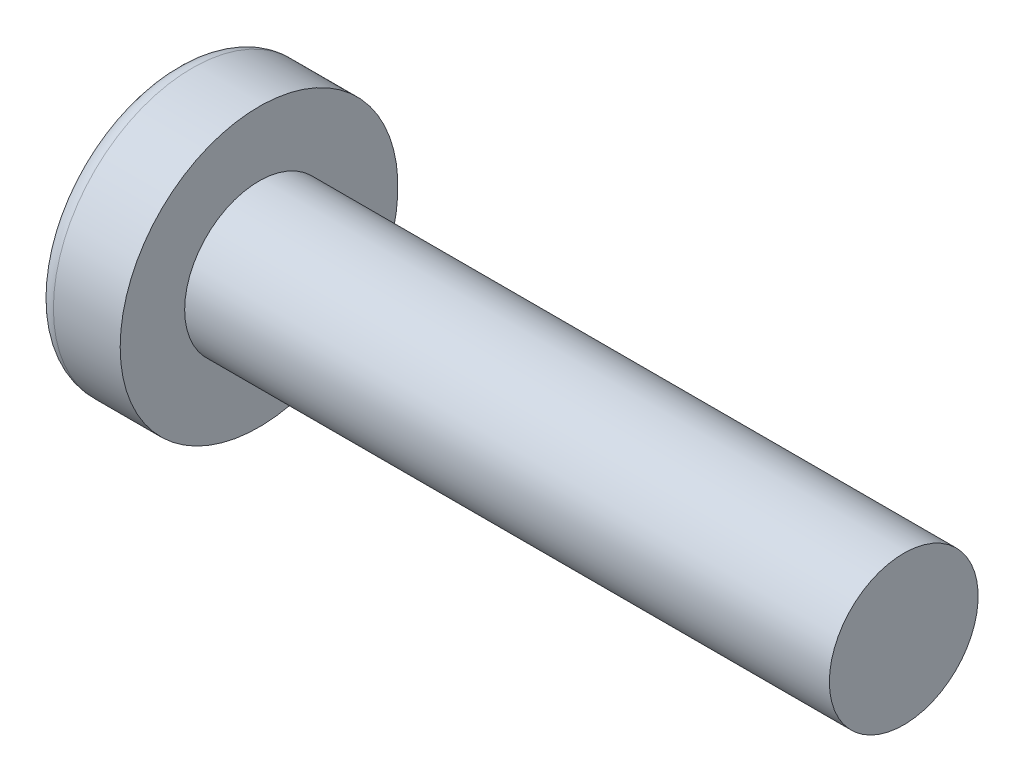
ISO-10303-21;
HEADER;
FILE_DESCRIPTION(('STEP AP214'),'2;1');
FILE_NAME('part.step','',(''),(''),'','','');
FILE_SCHEMA(('AUTOMOTIVE_DESIGN { 1 0 10303 214 1 1 1 1 }'));
ENDSEC;
DATA;
#1=APPLICATION_CONTEXT('core data for automotive mechanical design processes');
#2=APPLICATION_PROTOCOL_DEFINITION('international standard','automotive_design',2000,#1);
#3=PRODUCT_CONTEXT('',#1,'mechanical');
#4=PRODUCT('Part','Part','',(#3));
#5=PRODUCT_RELATED_PRODUCT_CATEGORY('part','',(#4));
#6=PRODUCT_DEFINITION_FORMATION('','',#4);
#7=PRODUCT_DEFINITION_CONTEXT('part definition',#1,'design');
#8=PRODUCT_DEFINITION('design','',#6,#7);
#9=PRODUCT_DEFINITION_SHAPE('','',#8);
#10=(LENGTH_UNIT() NAMED_UNIT(*) SI_UNIT(.MILLI.,.METRE.));
#11=(NAMED_UNIT(*) PLANE_ANGLE_UNIT() SI_UNIT($,.RADIAN.));
#12=(NAMED_UNIT(*) SI_UNIT($,.STERADIAN.) SOLID_ANGLE_UNIT());
#13=UNCERTAINTY_MEASURE_WITH_UNIT(LENGTH_MEASURE(1.E-05),#10,'distance_accuracy_value','');
#14=(GEOMETRIC_REPRESENTATION_CONTEXT(3) GLOBAL_UNCERTAINTY_ASSIGNED_CONTEXT((#13)) GLOBAL_UNIT_ASSIGNED_CONTEXT((#10,
#11,#12)) REPRESENTATION_CONTEXT('',''));
#15=CARTESIAN_POINT('',(0.,0.,0.));
#16=DIRECTION('',(0.,0.,1.));
#17=DIRECTION('',(1.,0.,0.));
#18=AXIS2_PLACEMENT_3D('',#15,#16,#17);
#19=CARTESIAN_POINT('',(5.,0.,0.));
#20=DIRECTION('',(-1.,0.,0.));
#21=DIRECTION('',(0.,1.,0.));
#22=AXIS2_PLACEMENT_3D('',#19,#20,#21);
#23=SPHERICAL_SURFACE('',#22,5.);
#24=CARTESIAN_POINT('',(0.747150706810477,0.,0.));
#25=DIRECTION('',(-1.,0.,0.));
#26=DIRECTION('',(0.,0.,1.));
#27=AXIS2_PLACEMENT_3D('',#24,#25,#26);
#28=CIRCLE('',#27,2.62931034482759);
#29=CARTESIAN_POINT('',(0.747150706810477,0.,2.62931034482759));
#30=VERTEX_POINT('',#29);
#31=EDGE_CURVE('E157',#30,#30,#28,.T.);
#32=ORIENTED_EDGE('',*,*,#31,.T.);
#33=EDGE_LOOP('',(#32));
#34=FACE_BOUND('',#33,.T.);
#35=CARTESIAN_POINT('',(4.98382636322272,-0.153868112043297,0.));
#36=DIRECTION('',(-0.104537710696287,-0.994520923380891,0.));
#37=DIRECTION('',(0.994520923380891,-0.104537710696287,0.));
#38=AXIS2_PLACEMENT_3D('',#35,#36,#37);
#39=CIRCLE('',#38,4.99760572850336);
#40=CARTESIAN_POINT('',(0.188596138461545,0.350175974082162,1.31444652548076));
#41=VERTEX_POINT('',#40);
#42=CARTESIAN_POINT('',(0.0270341343313624,0.367158343834486,0.367158343834487));
#43=VERTEX_POINT('',#42);
#44=EDGE_CURVE('E188',#41,#43,#39,.T.);
#45=ORIENTED_EDGE('',*,*,#44,.F.);
#46=CARTESIAN_POINT('',(3.98403090792016,0.,-1.41352221506761));
#47=DIRECTION('',(0.583636048152575,0.,0.812015371342713));
#48=DIRECTION('',(0.812015371342714,0.,-0.583636048152575));
#49=AXIS2_PLACEMENT_3D('',#46,#47,#48);
#50=CIRCLE('',#49,4.68719124331927);
#51=CARTESIAN_POINT('',(0.188596138461544,-0.350175974082172,1.31444652548076));
#52=VERTEX_POINT('',#51);
#53=EDGE_CURVE('E153',#41,#52,#50,.T.);
#54=ORIENTED_EDGE('',*,*,#53,.T.);
#55=CARTESIAN_POINT('',(4.98382636322272,0.153868112043297,0.));
#56=DIRECTION('',(-0.104537710696287,0.994520923380891,0.));
#57=DIRECTION('',(-0.994520923380891,-0.104537710696287,0.));
#58=AXIS2_PLACEMENT_3D('',#55,#56,#57);
#59=CIRCLE('',#58,4.99760572850336);
#60=CARTESIAN_POINT('',(0.0270341343313616,-0.367158343834489,0.367158343834487));
#61=VERTEX_POINT('',#60);
#62=EDGE_CURVE('E109',#61,#52,#59,.T.);
#63=ORIENTED_EDGE('',*,*,#62,.F.);
#64=CARTESIAN_POINT('',(4.98382636322272,0.,-0.153868112043297));
#65=DIRECTION('',(-0.104537710696287,0.,-0.994520923380891));
#66=DIRECTION('',(-0.994520923380891,0.,0.104537710696287));
#67=AXIS2_PLACEMENT_3D('',#64,#65,#66);
#68=CIRCLE('',#67,4.99760572850336);
#69=CARTESIAN_POINT('',(0.188596138461545,-1.31444652548077,0.350175974082167));
#70=VERTEX_POINT('',#69);
#71=EDGE_CURVE('E134',#70,#61,#68,.T.);
#72=ORIENTED_EDGE('',*,*,#71,.F.);
#73=CARTESIAN_POINT('',(3.98403090792016,1.41352221506761,0.));
#74=DIRECTION('',(0.583636048152575,-0.812015371342713,0.));
#75=DIRECTION('',(0.812015371342714,0.583636048152575,0.));
#76=AXIS2_PLACEMENT_3D('',#73,#74,#75);
#77=CIRCLE('',#76,4.68719124331927);
#78=CARTESIAN_POINT('',(0.188596138461545,-1.31444652548077,-0.350175974082167));
#79=VERTEX_POINT('',#78);
#80=EDGE_CURVE('E142',#70,#79,#77,.T.);
#81=ORIENTED_EDGE('',*,*,#80,.T.);
#82=CARTESIAN_POINT('',(4.98382636322272,0.,0.153868112043297));
#83=DIRECTION('',(-0.104537710696287,0.,0.994520923380891));
#84=DIRECTION('',(0.994520923380891,0.,0.104537710696287));
#85=AXIS2_PLACEMENT_3D('',#82,#83,#84);
#86=CIRCLE('',#85,4.99760572850336);
#87=CARTESIAN_POINT('',(0.0270341343313624,-0.367158343834486,-0.367158343834487));
#88=VERTEX_POINT('',#87);
#89=EDGE_CURVE('E52',#88,#79,#86,.T.);
#90=ORIENTED_EDGE('',*,*,#89,.F.);
#91=CARTESIAN_POINT('',(0.188596138461545,-0.350175974082162,-1.31444652548077));
#92=VERTEX_POINT('',#91);
#93=EDGE_CURVE('E195',#92,#88,#59,.T.);
#94=ORIENTED_EDGE('',*,*,#93,.F.);
#95=CARTESIAN_POINT('',(3.98403090792016,0.,1.41352221506761));
#96=DIRECTION('',(0.583636048152575,0.,-0.812015371342713));
#97=DIRECTION('',(-0.812015371342714,0.,-0.583636048152575));
#98=AXIS2_PLACEMENT_3D('',#95,#96,#97);
#99=CIRCLE('',#98,4.68719124331927);
#100=CARTESIAN_POINT('',(0.188596138461545,0.350175974082172,-1.31444652548076));
#101=VERTEX_POINT('',#100);
#102=EDGE_CURVE('E135',#92,#101,#99,.T.);
#103=ORIENTED_EDGE('',*,*,#102,.T.);
#104=CARTESIAN_POINT('',(0.0270341343313624,0.367158343834489,-0.367158343834487));
#105=VERTEX_POINT('',#104);
#106=EDGE_CURVE('E183',#105,#101,#39,.T.);
#107=ORIENTED_EDGE('',*,*,#106,.F.);
#108=CARTESIAN_POINT('',(0.188596138461546,1.31444652548076,-0.350175974082167));
#109=VERTEX_POINT('',#108);
#110=EDGE_CURVE('E45',#109,#105,#86,.T.);
#111=ORIENTED_EDGE('',*,*,#110,.F.);
#112=CARTESIAN_POINT('',(3.98403090792016,-1.41352221506761,0.));
#113=DIRECTION('',(0.583636048152575,0.812015371342713,0.));
#114=DIRECTION('',(-0.812015371342714,0.583636048152575,0.));
#115=AXIS2_PLACEMENT_3D('',#112,#113,#114);
#116=CIRCLE('',#115,4.68719124331927);
#117=CARTESIAN_POINT('',(0.188596138461546,1.31444652548076,0.350175974082167));
#118=VERTEX_POINT('',#117);
#119=EDGE_CURVE('E11',#109,#118,#116,.T.);
#120=ORIENTED_EDGE('',*,*,#119,.T.);
#121=EDGE_CURVE('E171',#43,#118,#68,.T.);
#122=ORIENTED_EDGE('',*,*,#121,.F.);
#123=EDGE_LOOP('',(#45,#54,#63,#72,#81,#90,#94,#103,#107,#111,#120,#122));
#124=FACE_BOUND('',#123,.T.);
#125=ADVANCED_FACE('F37',(#34,#124),#23,.T.);
#126=CARTESIAN_POINT('',(2.01739130434783,0.,-0.15794466403162));
#127=DIRECTION('',(-0.104537710696287,0.,0.994520923380891));
#128=DIRECTION('',(0.994520923380891,0.,0.104537710696287));
#129=AXIS2_PLACEMENT_3D('',#126,#127,#128);
#130=PLANE('',#129);
#131=ORIENTED_EDGE('',*,*,#110,.T.);
#132=DIRECTION('',(0.989130931836555,-0.103971149085093,0.103971149085092));
#133=VECTOR('',#132,1.);
#134=CARTESIAN_POINT('',(2.03363450411053,0.156237282238383,-0.156237282238382));
#135=LINE('',#134,#133);
#136=CARTESIAN_POINT('',(1.76,0.185000000000001,-0.184999999999999));
#137=VERTEX_POINT('',#136);
#138=EDGE_CURVE('E177',#105,#137,#135,.T.);
#139=ORIENTED_EDGE('',*,*,#138,.T.);
#140=DIRECTION('',(0.80907355338853,-0.581521616498006,0.0850446632823171));
#141=VECTOR('',#140,1.);
#142=CARTESIAN_POINT('',(0.,1.45,-0.37));
#143=LINE('',#142,#141);
#144=EDGE_CURVE('E158',#109,#137,#143,.T.);
#145=ORIENTED_EDGE('',*,*,#144,.F.);
#146=EDGE_LOOP('',(#131,#139,#145));
#147=FACE_BOUND('',#146,.T.);
#148=ADVANCED_FACE('F176',(#147),#130,.T.);
#149=DIRECTION('',(0.80907355338853,0.581521616498006,0.0850446632823171));
#150=VECTOR('',#149,1.);
#151=CARTESIAN_POINT('',(0.,-1.45,-0.37));
#152=LINE('',#151,#150);
#153=CARTESIAN_POINT('',(1.76,-0.185,-0.185));
#154=VERTEX_POINT('',#153);
#155=EDGE_CURVE('E143',#79,#154,#152,.T.);
#156=ORIENTED_EDGE('',*,*,#155,.T.);
#157=DIRECTION('',(-0.989130931836555,-0.103971149085092,-0.103971149085092));
#158=VECTOR('',#157,1.);
#159=CARTESIAN_POINT('',(2.03363450411053,-0.156237282238382,-0.156237282238382));
#160=LINE('',#159,#158);
#161=EDGE_CURVE('E198',#154,#88,#160,.T.);
#162=ORIENTED_EDGE('',*,*,#161,.T.);
#163=ORIENTED_EDGE('',*,*,#89,.T.);
#164=EDGE_LOOP('',(#156,#162,#163));
#165=FACE_BOUND('',#164,.T.);
#166=ADVANCED_FACE('F213',(#165),#130,.T.);
#167=CARTESIAN_POINT('',(2.01739130434783,0.,0.15794466403162));
#168=DIRECTION('',(-0.104537710696287,0.,-0.994520923380891));
#169=DIRECTION('',(-0.994520923380891,0.,0.104537710696287));
#170=AXIS2_PLACEMENT_3D('',#167,#168,#169);
#171=PLANE('',#170);
#172=DIRECTION('',(0.80907355338853,-0.581521616498006,-0.0850446632823171));
#173=VECTOR('',#172,1.);
#174=CARTESIAN_POINT('',(0.,1.45,0.37));
#175=LINE('',#174,#173);
#176=CARTESIAN_POINT('',(1.76,0.185,0.185));
#177=VERTEX_POINT('',#176);
#178=EDGE_CURVE('E214',#118,#177,#175,.T.);
#179=ORIENTED_EDGE('',*,*,#178,.T.);
#180=DIRECTION('',(-0.989130931836555,0.103971149085092,0.103971149085092));
#181=VECTOR('',#180,1.);
#182=CARTESIAN_POINT('',(2.03363450411053,0.156237282238382,0.156237282238382));
#183=LINE('',#182,#181);
#184=EDGE_CURVE('E192',#177,#43,#183,.T.);
#185=ORIENTED_EDGE('',*,*,#184,.T.);
#186=ORIENTED_EDGE('',*,*,#121,.T.);
#187=EDGE_LOOP('',(#179,#185,#186));
#188=FACE_BOUND('',#187,.T.);
#189=ADVANCED_FACE('F218',(#188),#171,.T.);
#190=ORIENTED_EDGE('',*,*,#71,.T.);
#191=DIRECTION('',(0.989130931836555,0.103971149085093,-0.103971149085092));
#192=VECTOR('',#191,1.);
#193=CARTESIAN_POINT('',(2.03363450411053,-0.156237282238383,0.156237282238382));
#194=LINE('',#193,#192);
#195=CARTESIAN_POINT('',(1.76,-0.185000000000001,0.184999999999999));
#196=VERTEX_POINT('',#195);
#197=EDGE_CURVE('E107',#61,#196,#194,.T.);
#198=ORIENTED_EDGE('',*,*,#197,.T.);
#199=DIRECTION('',(0.80907355338853,0.581521616498006,-0.085044663282317));
#200=VECTOR('',#199,1.);
#201=CARTESIAN_POINT('',(0.,-1.45,0.37));
#202=LINE('',#201,#200);
#203=EDGE_CURVE('E132',#70,#196,#202,.T.);
#204=ORIENTED_EDGE('',*,*,#203,.F.);
#205=EDGE_LOOP('',(#190,#198,#204));
#206=FACE_BOUND('',#205,.T.);
#207=ADVANCED_FACE('F131',(#206),#171,.T.);
#208=CARTESIAN_POINT('',(-25.4,0.,0.));
#209=DIRECTION('',(-1.,0.,0.));
#210=DIRECTION('',(0.,0.,1.));
#211=AXIS2_PLACEMENT_3D('',#208,#209,#210);
#212=CYLINDRICAL_SURFACE('',#211,1.5);
#213=CARTESIAN_POINT('',(15.4,0.,0.));
#214=DIRECTION('',(-1.,0.,0.));
#215=DIRECTION('',(0.,0.,1.));
#216=AXIS2_PLACEMENT_3D('',#213,#214,#215);
#217=CIRCLE('',#216,1.5);
#218=CARTESIAN_POINT('',(15.4,0.,1.5));
#219=VERTEX_POINT('',#218);
#220=EDGE_CURVE('E154',#219,#219,#217,.T.);
#221=ORIENTED_EDGE('',*,*,#220,.T.);
#222=EDGE_LOOP('',(#221));
#223=FACE_BOUND('',#222,.T.);
#224=CARTESIAN_POINT('',(2.4,0.,0.));
#225=DIRECTION('',(-1.,0.,0.));
#226=DIRECTION('',(0.,0.,1.));
#227=AXIS2_PLACEMENT_3D('',#224,#225,#226);
#228=CIRCLE('',#227,1.5);
#229=CARTESIAN_POINT('',(2.4,0.,1.5));
#230=VERTEX_POINT('',#229);
#231=EDGE_CURVE('E167',#230,#230,#228,.T.);
#232=ORIENTED_EDGE('',*,*,#231,.F.);
#233=EDGE_LOOP('',(#232));
#234=FACE_BOUND('',#233,.T.);
#235=ADVANCED_FACE('F39',(#223,#234),#212,.T.);
#236=CARTESIAN_POINT('',(2.4,1.5,0.));
#237=DIRECTION('',(-1.,0.,0.));
#238=DIRECTION('',(0.,0.,1.));
#239=AXIS2_PLACEMENT_3D('',#236,#237,#238);
#240=PLANE('',#239);
#241=CARTESIAN_POINT('',(2.4,0.,0.));
#242=DIRECTION('',(-1.,0.,0.));
#243=DIRECTION('',(0.,0.,1.));
#244=AXIS2_PLACEMENT_3D('',#241,#242,#243);
#245=CIRCLE('',#244,2.8);
#246=CARTESIAN_POINT('',(2.4,0.,2.8));
#247=VERTEX_POINT('',#246);
#248=EDGE_CURVE('E164',#247,#247,#245,.T.);
#249=ORIENTED_EDGE('',*,*,#248,.F.);
#250=EDGE_LOOP('',(#249));
#251=FACE_BOUND('',#250,.T.);
#252=ORIENTED_EDGE('',*,*,#231,.T.);
#253=EDGE_LOOP('',(#252));
#254=FACE_BOUND('',#253,.T.);
#255=ADVANCED_FACE('F246',(#251,#254),#240,.F.);
#256=CARTESIAN_POINT('',(-25.4,0.,0.));
#257=DIRECTION('',(-1.,0.,0.));
#258=DIRECTION('',(0.,0.,1.));
#259=AXIS2_PLACEMENT_3D('',#256,#257,#258);
#260=CYLINDRICAL_SURFACE('',#259,2.8);
#261=ORIENTED_EDGE('',*,*,#248,.T.);
#262=EDGE_LOOP('',(#261));
#263=FACE_BOUND('',#262,.T.);
#264=CARTESIAN_POINT('',(1.05335585592012,0.,0.));
#265=DIRECTION('',(-1.,0.,0.));
#266=DIRECTION('',(0.,0.,1.));
#267=AXIS2_PLACEMENT_3D('',#264,#265,#266);
#268=CIRCLE('',#267,2.8);
#269=CARTESIAN_POINT('',(1.05335585592012,0.,2.8));
#270=VERTEX_POINT('',#269);
#271=EDGE_CURVE('E161',#270,#270,#268,.T.);
#272=ORIENTED_EDGE('',*,*,#271,.F.);
#273=EDGE_LOOP('',(#272));
#274=FACE_BOUND('',#273,.T.);
#275=ADVANCED_FACE('F243',(#263,#274),#260,.T.);
#276=CARTESIAN_POINT('',(1.05335585592012,0.,0.));
#277=DIRECTION('',(-1.,0.,0.));
#278=DIRECTION('',(0.,0.,1.));
#279=AXIS2_PLACEMENT_3D('',#276,#277,#278);
#280=TOROIDAL_SURFACE('',#279,2.44,0.36);
#281=ORIENTED_EDGE('',*,*,#271,.T.);
#282=EDGE_LOOP('',(#281));
#283=FACE_BOUND('',#282,.T.);
#284=ORIENTED_EDGE('',*,*,#31,.F.);
#285=EDGE_LOOP('',(#284));
#286=FACE_BOUND('',#285,.T.);
#287=ADVANCED_FACE('F240',(#283,#286),#280,.T.);
#288=CARTESIAN_POINT('',(15.4,1.5,0.));
#289=DIRECTION('',(1.,0.,0.));
#290=DIRECTION('',(0.,0.,-1.));
#291=AXIS2_PLACEMENT_3D('',#288,#289,#290);
#292=PLANE('',#291);
#293=ORIENTED_EDGE('',*,*,#220,.F.);
#294=EDGE_LOOP('',(#293));
#295=FACE_BOUND('',#294,.T.);
#296=ADVANCED_FACE('F238',(#295),#292,.T.);
#297=CARTESIAN_POINT('',(1.76,0.185,0.185));
#298=DIRECTION('',(0.583636048152575,0.812015371342713,0.));
#299=DIRECTION('',(-0.812015371342714,0.583636048152575,0.));
#300=AXIS2_PLACEMENT_3D('',#297,#298,#299);
#301=PLANE('',#300);
#302=ORIENTED_EDGE('',*,*,#144,.T.);
#303=DIRECTION('',(0.,0.,-1.));
#304=VECTOR('',#303,1.);
#305=CARTESIAN_POINT('',(1.76,0.185,0.185));
#306=LINE('',#305,#304);
#307=EDGE_CURVE('E125',#177,#137,#306,.T.);
#308=ORIENTED_EDGE('',*,*,#307,.F.);
#309=ORIENTED_EDGE('',*,*,#178,.F.);
#310=ORIENTED_EDGE('',*,*,#119,.F.);
#311=EDGE_LOOP('',(#302,#308,#309,#310));
#312=FACE_BOUND('',#311,.T.);
#313=ADVANCED_FACE('F217',(#312),#301,.F.);
#314=CARTESIAN_POINT('',(1.76,-0.185,-0.185));
#315=DIRECTION('',(0.583636048152575,-0.812015371342713,0.));
#316=DIRECTION('',(0.812015371342714,0.583636048152575,0.));
#317=AXIS2_PLACEMENT_3D('',#314,#315,#316);
#318=PLANE('',#317);
#319=ORIENTED_EDGE('',*,*,#203,.T.);
#320=DIRECTION('',(0.,0.,1.));
#321=VECTOR('',#320,1.);
#322=CARTESIAN_POINT('',(1.76,-0.185,-0.185));
#323=LINE('',#322,#321);
#324=EDGE_CURVE('E124',#154,#196,#323,.T.);
#325=ORIENTED_EDGE('',*,*,#324,.F.);
#326=ORIENTED_EDGE('',*,*,#155,.F.);
#327=ORIENTED_EDGE('',*,*,#80,.F.);
#328=EDGE_LOOP('',(#319,#325,#326,#327));
#329=FACE_BOUND('',#328,.T.);
#330=ADVANCED_FACE('F139',(#329),#318,.F.);
#331=CARTESIAN_POINT('',(1.76,-0.185,-0.185));
#332=DIRECTION('',(1.,0.,0.));
#333=DIRECTION('',(0.,0.,-1.));
#334=AXIS2_PLACEMENT_3D('',#331,#332,#333);
#335=PLANE('',#334);
#336=DIRECTION('',(0.,1.,0.));
#337=VECTOR('',#336,1.);
#338=CARTESIAN_POINT('',(1.76,-0.185,-0.185));
#339=LINE('',#338,#337);
#340=EDGE_CURVE('E147',#154,#137,#339,.T.);
#341=ORIENTED_EDGE('',*,*,#340,.F.);
#342=ORIENTED_EDGE('',*,*,#324,.T.);
#343=DIRECTION('',(0.,-1.,0.));
#344=VECTOR('',#343,1.);
#345=CARTESIAN_POINT('',(1.76,0.185,0.185));
#346=LINE('',#345,#344);
#347=EDGE_CURVE('E116',#177,#196,#346,.T.);
#348=ORIENTED_EDGE('',*,*,#347,.F.);
#349=ORIENTED_EDGE('',*,*,#307,.T.);
#350=EDGE_LOOP('',(#341,#342,#348,#349));
#351=FACE_BOUND('',#350,.T.);
#352=ADVANCED_FACE('F145',(#351),#335,.F.);
#353=CARTESIAN_POINT('',(1.76,0.185000000000001,-0.184999999999999));
#354=DIRECTION('',(0.583636048152575,0.,-0.812015371342713));
#355=DIRECTION('',(0.812015371342714,0.,0.583636048152575));
#356=AXIS2_PLACEMENT_3D('',#353,#354,#355);
#357=PLANE('',#356);
#358=DIRECTION('',(0.80907355338853,0.085044663282315,0.581521616498006));
#359=VECTOR('',#358,1.);
#360=CARTESIAN_POINT('',(0.,-0.369999999999995,-1.45));
#361=LINE('',#360,#359);
#362=EDGE_CURVE('E203',#92,#154,#361,.T.);
#363=ORIENTED_EDGE('',*,*,#362,.T.);
#364=ORIENTED_EDGE('',*,*,#340,.T.);
#365=DIRECTION('',(0.80907355338853,-0.0850446632823191,0.581521616498006));
#366=VECTOR('',#365,1.);
#367=CARTESIAN_POINT('',(0.,0.370000000000005,-1.45));
#368=LINE('',#367,#366);
#369=EDGE_CURVE('E113',#101,#137,#368,.T.);
#370=ORIENTED_EDGE('',*,*,#369,.F.);
#371=ORIENTED_EDGE('',*,*,#102,.F.);
#372=EDGE_LOOP('',(#363,#364,#370,#371));
#373=FACE_BOUND('',#372,.T.);
#374=ADVANCED_FACE('F208',(#373),#357,.F.);
#375=CARTESIAN_POINT('',(2.01739130434783,-0.15794466403162,0.));
#376=DIRECTION('',(-0.104537710696287,0.994520923380891,0.));
#377=DIRECTION('',(-0.994520923380891,-0.104537710696287,0.));
#378=AXIS2_PLACEMENT_3D('',#375,#376,#377);
#379=PLANE('',#378);
#380=ORIENTED_EDGE('',*,*,#93,.T.);
#381=ORIENTED_EDGE('',*,*,#161,.F.);
#382=ORIENTED_EDGE('',*,*,#362,.F.);
#383=EDGE_LOOP('',(#380,#381,#382));
#384=FACE_BOUND('',#383,.T.);
#385=ADVANCED_FACE('F212',(#384),#379,.T.);
#386=CARTESIAN_POINT('',(2.01739130434783,0.15794466403162,0.));
#387=DIRECTION('',(-0.104537710696287,-0.994520923380891,0.));
#388=DIRECTION('',(0.994520923380891,-0.104537710696287,0.));
#389=AXIS2_PLACEMENT_3D('',#386,#387,#388);
#390=PLANE('',#389);
#391=ORIENTED_EDGE('',*,*,#106,.T.);
#392=ORIENTED_EDGE('',*,*,#369,.T.);
#393=ORIENTED_EDGE('',*,*,#138,.F.);
#394=EDGE_LOOP('',(#391,#392,#393));
#395=FACE_BOUND('',#394,.T.);
#396=ADVANCED_FACE('F206',(#395),#390,.T.);
#397=CARTESIAN_POINT('',(1.76,-0.185000000000001,0.184999999999999));
#398=DIRECTION('',(0.583636048152575,0.,0.812015371342713));
#399=DIRECTION('',(-0.812015371342714,0.,0.583636048152575));
#400=AXIS2_PLACEMENT_3D('',#397,#398,#399);
#401=PLANE('',#400);
#402=DIRECTION('',(0.80907355338853,-0.0850446632823151,-0.581521616498006));
#403=VECTOR('',#402,1.);
#404=CARTESIAN_POINT('',(0.,0.369999999999995,1.45));
#405=LINE('',#404,#403);
#406=EDGE_CURVE('E112',#41,#177,#405,.T.);
#407=ORIENTED_EDGE('',*,*,#406,.T.);
#408=ORIENTED_EDGE('',*,*,#347,.T.);
#409=DIRECTION('',(0.80907355338853,0.0850446632823191,-0.581521616498006));
#410=VECTOR('',#409,1.);
#411=CARTESIAN_POINT('',(0.,-0.370000000000005,1.45));
#412=LINE('',#411,#410);
#413=EDGE_CURVE('E103',#52,#196,#412,.T.);
#414=ORIENTED_EDGE('',*,*,#413,.F.);
#415=ORIENTED_EDGE('',*,*,#53,.F.);
#416=EDGE_LOOP('',(#407,#408,#414,#415));
#417=FACE_BOUND('',#416,.T.);
#418=ADVANCED_FACE('F117',(#417),#401,.F.);
#419=ORIENTED_EDGE('',*,*,#44,.T.);
#420=ORIENTED_EDGE('',*,*,#184,.F.);
#421=ORIENTED_EDGE('',*,*,#406,.F.);
#422=EDGE_LOOP('',(#419,#420,#421));
#423=FACE_BOUND('',#422,.T.);
#424=ADVANCED_FACE('F219',(#423),#390,.T.);
#425=ORIENTED_EDGE('',*,*,#62,.T.);
#426=ORIENTED_EDGE('',*,*,#413,.T.);
#427=ORIENTED_EDGE('',*,*,#197,.F.);
#428=EDGE_LOOP('',(#425,#426,#427));
#429=FACE_BOUND('',#428,.T.);
#430=ADVANCED_FACE('F105',(#429),#379,.T.);
#431=CLOSED_SHELL('',(#125,#148,#166,#189,#207,#235,#255,#275,#287,#296,#313,#330,#352,#374,
#385,#396,#418,#424,#430));
#432=MANIFOLD_SOLID_BREP('B2',#431);
#433=ADVANCED_BREP_SHAPE_REPRESENTATION('',(#18,#432),#14);
#434=SHAPE_DEFINITION_REPRESENTATION(#9,#433);
ENDSEC;
END-ISO-10303-21;
